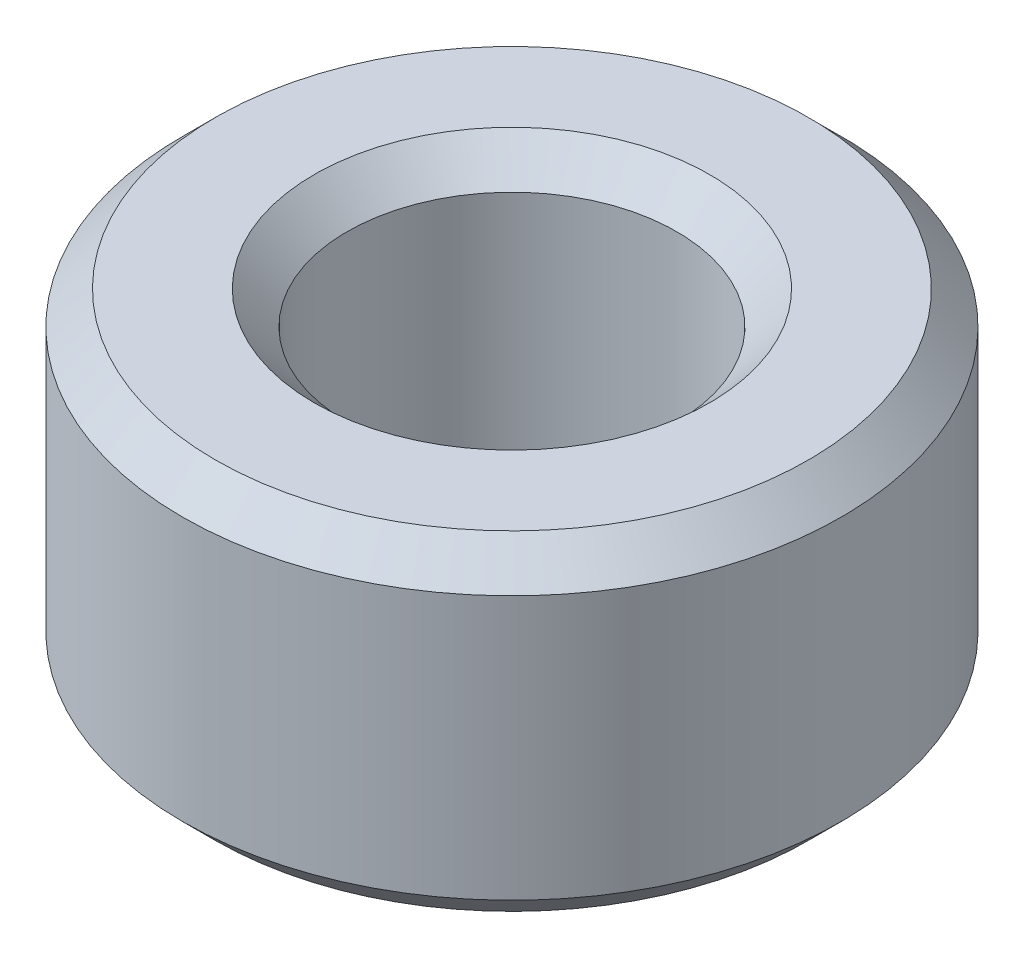
ISO-10303-21;
HEADER;
FILE_DESCRIPTION(('STEP AP214'),'2;1');
FILE_NAME('part.step','',(''),(''),'','','');
FILE_SCHEMA(('AUTOMOTIVE_DESIGN { 1 0 10303 214 1 1 1 1 }'));
ENDSEC;
DATA;
#1=APPLICATION_CONTEXT('core data for automotive mechanical design processes');
#2=APPLICATION_PROTOCOL_DEFINITION('international standard','automotive_design',2000,#1);
#3=PRODUCT_CONTEXT('',#1,'mechanical');
#4=PRODUCT('Part','Part','',(#3));
#5=PRODUCT_RELATED_PRODUCT_CATEGORY('part','',(#4));
#6=PRODUCT_DEFINITION_FORMATION('','',#4);
#7=PRODUCT_DEFINITION_CONTEXT('part definition',#1,'design');
#8=PRODUCT_DEFINITION('design','',#6,#7);
#9=PRODUCT_DEFINITION_SHAPE('','',#8);
#10=(LENGTH_UNIT() NAMED_UNIT(*) SI_UNIT(.MILLI.,.METRE.));
#11=(NAMED_UNIT(*) PLANE_ANGLE_UNIT() SI_UNIT($,.RADIAN.));
#12=(NAMED_UNIT(*) SI_UNIT($,.STERADIAN.) SOLID_ANGLE_UNIT());
#13=UNCERTAINTY_MEASURE_WITH_UNIT(LENGTH_MEASURE(1.E-05),#10,'distance_accuracy_value','');
#14=(GEOMETRIC_REPRESENTATION_CONTEXT(3) GLOBAL_UNCERTAINTY_ASSIGNED_CONTEXT((#13)) GLOBAL_UNIT_ASSIGNED_CONTEXT((#10,
#11,#12)) REPRESENTATION_CONTEXT('',''));
#15=CARTESIAN_POINT('',(0.,0.,0.));
#16=DIRECTION('',(0.,0.,1.));
#17=DIRECTION('',(1.,0.,0.));
#18=AXIS2_PLACEMENT_3D('',#15,#16,#17);
#19=CARTESIAN_POINT('',(0.,10.,0.));
#20=DIRECTION('',(0.,-1.,0.));
#21=DIRECTION('',(0.,0.,-1.));
#22=AXIS2_PLACEMENT_3D('',#19,#20,#21);
#23=CYLINDRICAL_SURFACE('',#22,10.);
#24=CARTESIAN_POINT('',(0.,0.999999999999997,0.));
#25=DIRECTION('',(0.,1.,0.));
#26=DIRECTION('',(0.,0.,1.));
#27=AXIS2_PLACEMENT_3D('',#24,#25,#26);
#28=CIRCLE('',#27,10.);
#29=CARTESIAN_POINT('',(0.,0.999999999999997,10.));
#30=VERTEX_POINT('',#29);
#31=EDGE_CURVE('E10',#30,#30,#28,.T.);
#32=ORIENTED_EDGE('',*,*,#31,.T.);
#33=EDGE_LOOP('',(#32));
#34=FACE_BOUND('',#33,.T.);
#35=CARTESIAN_POINT('',(0.,8.99999999999999,0.));
#36=DIRECTION('',(0.,1.,0.));
#37=DIRECTION('',(0.,0.,1.));
#38=AXIS2_PLACEMENT_3D('',#35,#36,#37);
#39=CIRCLE('',#38,10.);
#40=CARTESIAN_POINT('',(0.,8.99999999999999,10.));
#41=VERTEX_POINT('',#40);
#42=EDGE_CURVE('E50',#41,#41,#39,.F.);
#43=ORIENTED_EDGE('',*,*,#42,.T.);
#44=EDGE_LOOP('',(#43));
#45=FACE_BOUND('',#44,.T.);
#46=ADVANCED_FACE('F39',(#34,#45),#23,.T.);
#47=CARTESIAN_POINT('',(0.,10.,0.));
#48=DIRECTION('',(0.,1.,0.));
#49=DIRECTION('',(0.,0.,1.));
#50=AXIS2_PLACEMENT_3D('',#47,#48,#49);
#51=PLANE('',#50);
#52=CARTESIAN_POINT('',(0.,10.,0.));
#53=DIRECTION('',(0.,1.,0.));
#54=DIRECTION('',(0.,0.,1.));
#55=AXIS2_PLACEMENT_3D('',#52,#53,#54);
#56=CIRCLE('',#55,6.);
#57=CARTESIAN_POINT('',(0.,10.,6.));
#58=VERTEX_POINT('',#57);
#59=EDGE_CURVE('E58',#58,#58,#56,.F.);
#60=ORIENTED_EDGE('',*,*,#59,.T.);
#61=EDGE_LOOP('',(#60));
#62=FACE_BOUND('',#61,.T.);
#63=CARTESIAN_POINT('',(0.,10.,0.));
#64=DIRECTION('',(0.,1.,0.));
#65=DIRECTION('',(0.,0.,1.));
#66=AXIS2_PLACEMENT_3D('',#63,#64,#65);
#67=CIRCLE('',#66,9.);
#68=CARTESIAN_POINT('',(0.,10.,9.));
#69=VERTEX_POINT('',#68);
#70=EDGE_CURVE('E65',#69,#69,#67,.T.);
#71=ORIENTED_EDGE('',*,*,#70,.T.);
#72=EDGE_LOOP('',(#71));
#73=FACE_BOUND('',#72,.T.);
#74=ADVANCED_FACE('F88',(#62,#73),#51,.T.);
#75=CARTESIAN_POINT('',(0.,0.,0.));
#76=DIRECTION('',(0.,1.,0.));
#77=DIRECTION('',(0.,0.,1.));
#78=AXIS2_PLACEMENT_3D('',#75,#76,#77);
#79=PLANE('',#78);
#80=CARTESIAN_POINT('',(0.,0.,0.));
#81=DIRECTION('',(0.,1.,0.));
#82=DIRECTION('',(0.,0.,1.));
#83=AXIS2_PLACEMENT_3D('',#80,#81,#82);
#84=CIRCLE('',#83,6.);
#85=CARTESIAN_POINT('',(0.,0.,6.));
#86=VERTEX_POINT('',#85);
#87=EDGE_CURVE('E51',#86,#86,#84,.T.);
#88=ORIENTED_EDGE('',*,*,#87,.T.);
#89=EDGE_LOOP('',(#88));
#90=FACE_BOUND('',#89,.T.);
#91=CARTESIAN_POINT('',(0.,0.,0.));
#92=DIRECTION('',(0.,1.,0.));
#93=DIRECTION('',(0.,0.,1.));
#94=AXIS2_PLACEMENT_3D('',#91,#92,#93);
#95=CIRCLE('',#94,9.);
#96=CARTESIAN_POINT('',(0.,0.,9.));
#97=VERTEX_POINT('',#96);
#98=EDGE_CURVE('E54',#97,#97,#95,.F.);
#99=ORIENTED_EDGE('',*,*,#98,.T.);
#100=EDGE_LOOP('',(#99));
#101=FACE_BOUND('',#100,.T.);
#102=ADVANCED_FACE('F84',(#90,#101),#79,.F.);
#103=CARTESIAN_POINT('',(0.,10.,0.));
#104=DIRECTION('',(0.,-1.,0.));
#105=DIRECTION('',(0.,0.,-1.));
#106=AXIS2_PLACEMENT_3D('',#103,#104,#105);
#107=CYLINDRICAL_SURFACE('',#106,5.);
#108=CARTESIAN_POINT('',(0.,9.00000000000001,0.));
#109=DIRECTION('',(0.,1.,0.));
#110=DIRECTION('',(0.,0.,1.));
#111=AXIS2_PLACEMENT_3D('',#108,#109,#110);
#112=CIRCLE('',#111,5.);
#113=CARTESIAN_POINT('',(0.,9.00000000000001,5.));
#114=VERTEX_POINT('',#113);
#115=EDGE_CURVE('E66',#114,#114,#112,.T.);
#116=ORIENTED_EDGE('',*,*,#115,.T.);
#117=EDGE_LOOP('',(#116));
#118=FACE_BOUND('',#117,.T.);
#119=CARTESIAN_POINT('',(0.,1.00000000000001,0.));
#120=DIRECTION('',(0.,1.,0.));
#121=DIRECTION('',(0.,0.,1.));
#122=AXIS2_PLACEMENT_3D('',#119,#120,#121);
#123=CIRCLE('',#122,5.);
#124=CARTESIAN_POINT('',(0.,1.00000000000001,5.));
#125=VERTEX_POINT('',#124);
#126=EDGE_CURVE('E68',#125,#125,#123,.F.);
#127=ORIENTED_EDGE('',*,*,#126,.T.);
#128=EDGE_LOOP('',(#127));
#129=FACE_BOUND('',#128,.T.);
#130=ADVANCED_FACE('F71',(#118,#129),#107,.F.);
#131=CARTESIAN_POINT('',(0.,9.00000000000001,0.));
#132=DIRECTION('',(0.,1.,0.));
#133=DIRECTION('',(0.,0.,1.));
#134=AXIS2_PLACEMENT_3D('',#131,#132,#133);
#135=CONICAL_SURFACE('',#134,5.,0.78539816339745);
#136=ORIENTED_EDGE('',*,*,#59,.F.);
#137=EDGE_LOOP('',(#136));
#138=FACE_BOUND('',#137,.T.);
#139=ORIENTED_EDGE('',*,*,#115,.F.);
#140=EDGE_LOOP('',(#139));
#141=FACE_BOUND('',#140,.T.);
#142=ADVANCED_FACE('F76',(#138,#141),#135,.F.);
#143=CARTESIAN_POINT('',(0.,0.,0.));
#144=DIRECTION('',(0.,-1.,0.));
#145=DIRECTION('',(0.,0.,-1.));
#146=AXIS2_PLACEMENT_3D('',#143,#144,#145);
#147=CONICAL_SURFACE('',#146,6.,0.785398163397446);
#148=ORIENTED_EDGE('',*,*,#126,.F.);
#149=EDGE_LOOP('',(#148));
#150=FACE_BOUND('',#149,.T.);
#151=ORIENTED_EDGE('',*,*,#87,.F.);
#152=EDGE_LOOP('',(#151));
#153=FACE_BOUND('',#152,.T.);
#154=ADVANCED_FACE('F73',(#150,#153),#147,.F.);
#155=CARTESIAN_POINT('',(0.,0.999999999999997,0.));
#156=DIRECTION('',(0.,1.,0.));
#157=DIRECTION('',(0.,0.,1.));
#158=AXIS2_PLACEMENT_3D('',#155,#156,#157);
#159=CONICAL_SURFACE('',#158,10.,0.78539816339745);
#160=ORIENTED_EDGE('',*,*,#98,.F.);
#161=EDGE_LOOP('',(#160));
#162=FACE_BOUND('',#161,.T.);
#163=ORIENTED_EDGE('',*,*,#31,.F.);
#164=EDGE_LOOP('',(#163));
#165=FACE_BOUND('',#164,.T.);
#166=ADVANCED_FACE('F80',(#162,#165),#159,.T.);
#167=CARTESIAN_POINT('',(0.,10.,0.));
#168=DIRECTION('',(0.,-1.,0.));
#169=DIRECTION('',(0.,0.,-1.));
#170=AXIS2_PLACEMENT_3D('',#167,#168,#169);
#171=CONICAL_SURFACE('',#170,9.,0.785398163397447);
#172=ORIENTED_EDGE('',*,*,#42,.F.);
#173=EDGE_LOOP('',(#172));
#174=FACE_BOUND('',#173,.T.);
#175=ORIENTED_EDGE('',*,*,#70,.F.);
#176=EDGE_LOOP('',(#175));
#177=FACE_BOUND('',#176,.T.);
#178=ADVANCED_FACE('F45',(#174,#177),#171,.T.);
#179=CLOSED_SHELL('',(#46,#74,#102,#130,#142,#154,#166,#178));
#180=MANIFOLD_SOLID_BREP('B2',#179);
#181=ADVANCED_BREP_SHAPE_REPRESENTATION('',(#18,#180),#14);
#182=SHAPE_DEFINITION_REPRESENTATION(#9,#181);
ENDSEC;
END-ISO-10303-21;
